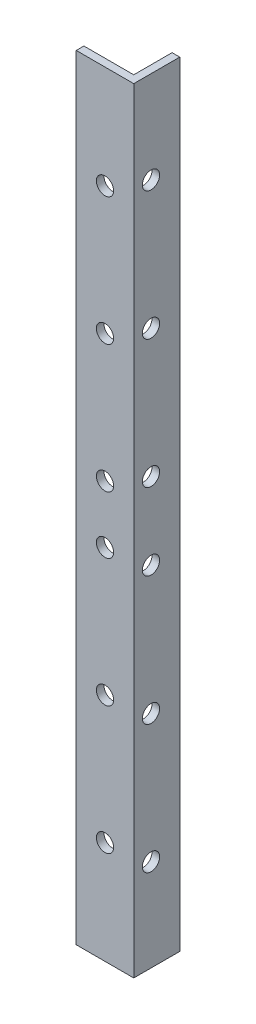
ISO-10303-21;
HEADER;
FILE_DESCRIPTION(('STEP AP214'),'2;1');
FILE_NAME('part.step','',(''),(''),'','','');
FILE_SCHEMA(('AUTOMOTIVE_DESIGN { 1 0 10303 214 1 1 1 1 }'));
ENDSEC;
DATA;
#1=APPLICATION_CONTEXT('core data for automotive mechanical design processes');
#2=APPLICATION_PROTOCOL_DEFINITION('international standard','automotive_design',2000,#1);
#3=PRODUCT_CONTEXT('',#1,'mechanical');
#4=PRODUCT('Part','Part','',(#3));
#5=PRODUCT_RELATED_PRODUCT_CATEGORY('part','',(#4));
#6=PRODUCT_DEFINITION_FORMATION('','',#4);
#7=PRODUCT_DEFINITION_CONTEXT('part definition',#1,'design');
#8=PRODUCT_DEFINITION('design','',#6,#7);
#9=PRODUCT_DEFINITION_SHAPE('','',#8);
#10=(LENGTH_UNIT() NAMED_UNIT(*) SI_UNIT(.MILLI.,.METRE.));
#11=(NAMED_UNIT(*) PLANE_ANGLE_UNIT() SI_UNIT($,.RADIAN.));
#12=(NAMED_UNIT(*) SI_UNIT($,.STERADIAN.) SOLID_ANGLE_UNIT());
#13=UNCERTAINTY_MEASURE_WITH_UNIT(LENGTH_MEASURE(1.E-05),#10,'distance_accuracy_value','');
#14=(GEOMETRIC_REPRESENTATION_CONTEXT(3) GLOBAL_UNCERTAINTY_ASSIGNED_CONTEXT((#13)) GLOBAL_UNIT_ASSIGNED_CONTEXT((#10,
#11,#12)) REPRESENTATION_CONTEXT('',''));
#15=CARTESIAN_POINT('',(0.,0.,0.));
#16=DIRECTION('',(0.,0.,1.));
#17=DIRECTION('',(1.,0.,0.));
#18=AXIS2_PLACEMENT_3D('',#15,#16,#17);
#19=CARTESIAN_POINT('',(0.,202.,-2.));
#20=DIRECTION('',(1.,0.,0.));
#21=DIRECTION('',(0.,0.,-1.));
#22=AXIS2_PLACEMENT_3D('',#19,#20,#21);
#23=PLANE('',#22);
#24=DIRECTION('',(0.,0.,1.));
#25=VECTOR('',#24,1.);
#26=CARTESIAN_POINT('',(0.,0.,-2.));
#27=LINE('',#26,#25);
#28=CARTESIAN_POINT('',(0.,0.,-2.));
#29=VERTEX_POINT('',#28);
#30=CARTESIAN_POINT('',(0.,0.,0.));
#31=VERTEX_POINT('',#30);
#32=EDGE_CURVE('E123',#29,#31,#27,.T.);
#33=ORIENTED_EDGE('',*,*,#32,.T.);
#34=DIRECTION('',(0.,-1.,0.));
#35=VECTOR('',#34,1.);
#36=CARTESIAN_POINT('',(0.,202.,0.));
#37=LINE('',#36,#35);
#38=CARTESIAN_POINT('',(0.,202.,0.));
#39=VERTEX_POINT('',#38);
#40=EDGE_CURVE('E11',#39,#31,#37,.T.);
#41=ORIENTED_EDGE('',*,*,#40,.F.);
#42=DIRECTION('',(0.,0.,1.));
#43=VECTOR('',#42,1.);
#44=CARTESIAN_POINT('',(0.,202.,-2.));
#45=LINE('',#44,#43);
#46=CARTESIAN_POINT('',(0.,202.,-2.));
#47=VERTEX_POINT('',#46);
#48=EDGE_CURVE('E134',#47,#39,#45,.T.);
#49=ORIENTED_EDGE('',*,*,#48,.F.);
#50=DIRECTION('',(0.,-1.,0.));
#51=VECTOR('',#50,1.);
#52=CARTESIAN_POINT('',(0.,202.,-2.));
#53=LINE('',#52,#51);
#54=EDGE_CURVE('E119',#47,#29,#53,.T.);
#55=ORIENTED_EDGE('',*,*,#54,.T.);
#56=EDGE_LOOP('',(#33,#41,#49,#55));
#57=FACE_BOUND('',#56,.T.);
#58=ADVANCED_FACE('F39',(#57),#23,.F.);
#59=CARTESIAN_POINT('',(0.,202.,0.));
#60=DIRECTION('',(0.,0.,-1.));
#61=DIRECTION('',(-1.,0.,0.));
#62=AXIS2_PLACEMENT_3D('',#59,#60,#61);
#63=PLANE('',#62);
#64=CARTESIAN_POINT('',(7.50000000000005,175.166666666667,0.));
#65=DIRECTION('',(0.,0.,1.));
#66=DIRECTION('',(1.,0.,0.));
#67=AXIS2_PLACEMENT_3D('',#64,#65,#66);
#68=CIRCLE('',#67,2.24999999999998);
#69=CARTESIAN_POINT('',(9.75000000000003,175.166666666667,0.));
#70=VERTEX_POINT('',#69);
#71=EDGE_CURVE('E463',#70,#70,#68,.T.);
#72=ORIENTED_EDGE('',*,*,#71,.F.);
#73=EDGE_LOOP('',(#72));
#74=FACE_BOUND('',#73,.T.);
#75=CARTESIAN_POINT('',(7.50000000000005,141.833333333333,0.));
#76=DIRECTION('',(0.,0.,1.));
#77=DIRECTION('',(1.,0.,0.));
#78=AXIS2_PLACEMENT_3D('',#75,#76,#77);
#79=CIRCLE('',#78,2.25);
#80=CARTESIAN_POINT('',(9.75000000000005,141.833333333333,0.));
#81=VERTEX_POINT('',#80);
#82=EDGE_CURVE('E466',#81,#81,#79,.T.);
#83=ORIENTED_EDGE('',*,*,#82,.F.);
#84=EDGE_LOOP('',(#83));
#85=FACE_BOUND('',#84,.T.);
#86=CARTESIAN_POINT('',(7.50000000000005,108.5,0.));
#87=DIRECTION('',(0.,0.,1.));
#88=DIRECTION('',(1.,0.,0.));
#89=AXIS2_PLACEMENT_3D('',#86,#87,#88);
#90=CIRCLE('',#89,2.25);
#91=CARTESIAN_POINT('',(9.75000000000005,108.5,0.));
#92=VERTEX_POINT('',#91);
#93=EDGE_CURVE('E472',#92,#92,#90,.T.);
#94=ORIENTED_EDGE('',*,*,#93,.F.);
#95=EDGE_LOOP('',(#94));
#96=FACE_BOUND('',#95,.T.);
#97=CARTESIAN_POINT('',(7.50000000000005,93.5,0.));
#98=DIRECTION('',(0.,0.,1.));
#99=DIRECTION('',(1.,0.,0.));
#100=AXIS2_PLACEMENT_3D('',#97,#98,#99);
#101=CIRCLE('',#100,2.25);
#102=CARTESIAN_POINT('',(9.75000000000005,93.5,0.));
#103=VERTEX_POINT('',#102);
#104=EDGE_CURVE('E478',#103,#103,#101,.T.);
#105=ORIENTED_EDGE('',*,*,#104,.F.);
#106=EDGE_LOOP('',(#105));
#107=FACE_BOUND('',#106,.T.);
#108=CARTESIAN_POINT('',(7.50000000000005,60.1666666666667,0.));
#109=DIRECTION('',(0.,0.,1.));
#110=DIRECTION('',(1.,0.,0.));
#111=AXIS2_PLACEMENT_3D('',#108,#109,#110);
#112=CIRCLE('',#111,2.24999999999998);
#113=CARTESIAN_POINT('',(9.75000000000003,60.1666666666667,0.));
#114=VERTEX_POINT('',#113);
#115=EDGE_CURVE('E484',#114,#114,#112,.T.);
#116=ORIENTED_EDGE('',*,*,#115,.F.);
#117=EDGE_LOOP('',(#116));
#118=FACE_BOUND('',#117,.T.);
#119=CARTESIAN_POINT('',(7.50000000000005,26.8333333333334,0.));
#120=DIRECTION('',(0.,0.,1.));
#121=DIRECTION('',(1.,0.,0.));
#122=AXIS2_PLACEMENT_3D('',#119,#120,#121);
#123=CIRCLE('',#122,2.24999999999999);
#124=CARTESIAN_POINT('',(9.75000000000004,26.8333333333334,0.));
#125=VERTEX_POINT('',#124);
#126=EDGE_CURVE('E429',#125,#125,#123,.T.);
#127=ORIENTED_EDGE('',*,*,#126,.F.);
#128=EDGE_LOOP('',(#127));
#129=FACE_BOUND('',#128,.T.);
#130=DIRECTION('',(1.,0.,0.));
#131=VECTOR('',#130,1.);
#132=CARTESIAN_POINT('',(0.,0.,0.));
#133=LINE('',#132,#131);
#134=CARTESIAN_POINT('',(15.,0.,0.));
#135=VERTEX_POINT('',#134);
#136=EDGE_CURVE('E126',#31,#135,#133,.T.);
#137=ORIENTED_EDGE('',*,*,#136,.T.);
#138=DIRECTION('',(0.,-1.,0.));
#139=VECTOR('',#138,1.);
#140=CARTESIAN_POINT('',(15.,202.,0.));
#141=LINE('',#140,#139);
#142=CARTESIAN_POINT('',(15.,202.,0.));
#143=VERTEX_POINT('',#142);
#144=EDGE_CURVE('E47',#143,#135,#141,.T.);
#145=ORIENTED_EDGE('',*,*,#144,.F.);
#146=DIRECTION('',(1.,0.,0.));
#147=VECTOR('',#146,1.);
#148=CARTESIAN_POINT('',(0.,202.,0.));
#149=LINE('',#148,#147);
#150=EDGE_CURVE('E92',#39,#143,#149,.T.);
#151=ORIENTED_EDGE('',*,*,#150,.F.);
#152=ORIENTED_EDGE('',*,*,#40,.T.);
#153=EDGE_LOOP('',(#137,#145,#151,#152));
#154=FACE_BOUND('',#153,.T.);
#155=ADVANCED_FACE('F162',(#74,#85,#96,#107,#118,#129,#154),#63,.F.);
#156=CARTESIAN_POINT('',(15.,202.,0.));
#157=DIRECTION('',(-1.,0.,0.));
#158=DIRECTION('',(0.,0.,1.));
#159=AXIS2_PLACEMENT_3D('',#156,#157,#158);
#160=PLANE('',#159);
#161=CARTESIAN_POINT('',(15.,23.9999999999999,-4.50000000000011));
#162=DIRECTION('',(1.,0.,0.));
#163=DIRECTION('',(0.,0.,-1.));
#164=AXIS2_PLACEMENT_3D('',#161,#162,#163);
#165=CIRCLE('',#164,2.24999999999999);
#166=CARTESIAN_POINT('',(15.,23.9999999999999,-6.7500000000001));
#167=VERTEX_POINT('',#166);
#168=EDGE_CURVE('E422',#167,#167,#165,.T.);
#169=ORIENTED_EDGE('',*,*,#168,.F.);
#170=EDGE_LOOP('',(#169));
#171=FACE_BOUND('',#170,.T.);
#172=CARTESIAN_POINT('',(15.,57.4999999999999,-4.50000000000011));
#173=DIRECTION('',(1.,0.,0.));
#174=DIRECTION('',(0.,0.,-1.));
#175=AXIS2_PLACEMENT_3D('',#172,#173,#174);
#176=CIRCLE('',#175,2.24999999999999);
#177=CARTESIAN_POINT('',(15.,57.4999999999999,-6.7500000000001));
#178=VERTEX_POINT('',#177);
#179=EDGE_CURVE('E431',#178,#178,#176,.T.);
#180=ORIENTED_EDGE('',*,*,#179,.F.);
#181=EDGE_LOOP('',(#180));
#182=FACE_BOUND('',#181,.T.);
#183=CARTESIAN_POINT('',(15.,90.9999999999999,-4.50000000000006));
#184=DIRECTION('',(1.,0.,0.));
#185=DIRECTION('',(0.,0.,-1.));
#186=AXIS2_PLACEMENT_3D('',#183,#184,#185);
#187=CIRCLE('',#186,2.24999999999999);
#188=CARTESIAN_POINT('',(15.,90.9999999999999,-6.75000000000005));
#189=VERTEX_POINT('',#188);
#190=EDGE_CURVE('E437',#189,#189,#187,.T.);
#191=ORIENTED_EDGE('',*,*,#190,.F.);
#192=EDGE_LOOP('',(#191));
#193=FACE_BOUND('',#192,.T.);
#194=CARTESIAN_POINT('',(15.,111.,-4.50000000000006));
#195=DIRECTION('',(1.,0.,0.));
#196=DIRECTION('',(0.,0.,-1.));
#197=AXIS2_PLACEMENT_3D('',#194,#195,#196);
#198=CIRCLE('',#197,2.24999999999999);
#199=CARTESIAN_POINT('',(15.,111.,-6.75000000000005));
#200=VERTEX_POINT('',#199);
#201=EDGE_CURVE('E443',#200,#200,#198,.T.);
#202=ORIENTED_EDGE('',*,*,#201,.F.);
#203=EDGE_LOOP('',(#202));
#204=FACE_BOUND('',#203,.T.);
#205=CARTESIAN_POINT('',(15.,144.5,-4.50000000000011));
#206=DIRECTION('',(1.,0.,0.));
#207=DIRECTION('',(0.,0.,-1.));
#208=AXIS2_PLACEMENT_3D('',#205,#206,#207);
#209=CIRCLE('',#208,2.25);
#210=CARTESIAN_POINT('',(15.,144.5,-6.75000000000012));
#211=VERTEX_POINT('',#210);
#212=EDGE_CURVE('E449',#211,#211,#209,.T.);
#213=ORIENTED_EDGE('',*,*,#212,.F.);
#214=EDGE_LOOP('',(#213));
#215=FACE_BOUND('',#214,.T.);
#216=CARTESIAN_POINT('',(15.,178.,-4.50000000000011));
#217=DIRECTION('',(1.,0.,0.));
#218=DIRECTION('',(0.,0.,-1.));
#219=AXIS2_PLACEMENT_3D('',#216,#217,#218);
#220=CIRCLE('',#219,2.25);
#221=CARTESIAN_POINT('',(15.,178.,-6.75000000000012));
#222=VERTEX_POINT('',#221);
#223=EDGE_CURVE('E455',#222,#222,#220,.T.);
#224=ORIENTED_EDGE('',*,*,#223,.F.);
#225=EDGE_LOOP('',(#224));
#226=FACE_BOUND('',#225,.T.);
#227=DIRECTION('',(0.,0.,-1.));
#228=VECTOR('',#227,1.);
#229=CARTESIAN_POINT('',(15.,0.,0.));
#230=LINE('',#229,#228);
#231=CARTESIAN_POINT('',(15.,0.,-12.));
#232=VERTEX_POINT('',#231);
#233=EDGE_CURVE('E129',#135,#232,#230,.T.);
#234=ORIENTED_EDGE('',*,*,#233,.T.);
#235=DIRECTION('',(0.,-1.,0.));
#236=VECTOR('',#235,1.);
#237=CARTESIAN_POINT('',(15.,202.,-12.));
#238=LINE('',#237,#236);
#239=CARTESIAN_POINT('',(15.,202.,-12.));
#240=VERTEX_POINT('',#239);
#241=EDGE_CURVE('E114',#240,#232,#238,.T.);
#242=ORIENTED_EDGE('',*,*,#241,.F.);
#243=DIRECTION('',(0.,0.,-1.));
#244=VECTOR('',#243,1.);
#245=CARTESIAN_POINT('',(15.,202.,0.));
#246=LINE('',#245,#244);
#247=EDGE_CURVE('E105',#143,#240,#246,.T.);
#248=ORIENTED_EDGE('',*,*,#247,.F.);
#249=ORIENTED_EDGE('',*,*,#144,.T.);
#250=EDGE_LOOP('',(#234,#242,#248,#249));
#251=FACE_BOUND('',#250,.T.);
#252=ADVANCED_FACE('F140',(#171,#182,#193,#204,#215,#226,#251),#160,.F.);
#253=CARTESIAN_POINT('',(15.,202.,-12.));
#254=DIRECTION('',(0.,0.,1.));
#255=DIRECTION('',(1.,0.,0.));
#256=AXIS2_PLACEMENT_3D('',#253,#254,#255);
#257=PLANE('',#256);
#258=DIRECTION('',(-1.,0.,0.));
#259=VECTOR('',#258,1.);
#260=CARTESIAN_POINT('',(15.,0.,-12.));
#261=LINE('',#260,#259);
#262=CARTESIAN_POINT('',(13.,0.,-12.));
#263=VERTEX_POINT('',#262);
#264=EDGE_CURVE('E113',#232,#263,#261,.T.);
#265=ORIENTED_EDGE('',*,*,#264,.T.);
#266=DIRECTION('',(0.,-1.,0.));
#267=VECTOR('',#266,1.);
#268=CARTESIAN_POINT('',(13.,202.,-12.));
#269=LINE('',#268,#267);
#270=CARTESIAN_POINT('',(13.,202.,-12.));
#271=VERTEX_POINT('',#270);
#272=EDGE_CURVE('E110',#271,#263,#269,.T.);
#273=ORIENTED_EDGE('',*,*,#272,.F.);
#274=DIRECTION('',(-1.,0.,0.));
#275=VECTOR('',#274,1.);
#276=CARTESIAN_POINT('',(15.,202.,-12.));
#277=LINE('',#276,#275);
#278=EDGE_CURVE('E99',#240,#271,#277,.T.);
#279=ORIENTED_EDGE('',*,*,#278,.F.);
#280=ORIENTED_EDGE('',*,*,#241,.T.);
#281=EDGE_LOOP('',(#265,#273,#279,#280));
#282=FACE_BOUND('',#281,.T.);
#283=ADVANCED_FACE('F111',(#282),#257,.F.);
#284=CARTESIAN_POINT('',(13.,202.,-12.));
#285=DIRECTION('',(1.,0.,0.));
#286=DIRECTION('',(0.,0.,-1.));
#287=AXIS2_PLACEMENT_3D('',#284,#285,#286);
#288=PLANE('',#287);
#289=CARTESIAN_POINT('',(13.,23.9999999999999,-4.50000000000011));
#290=DIRECTION('',(1.,0.,0.));
#291=DIRECTION('',(0.,0.,-1.));
#292=AXIS2_PLACEMENT_3D('',#289,#290,#291);
#293=CIRCLE('',#292,2.24999999999999);
#294=CARTESIAN_POINT('',(13.,23.9999999999999,-6.7500000000001));
#295=VERTEX_POINT('',#294);
#296=EDGE_CURVE('E425',#295,#295,#293,.F.);
#297=ORIENTED_EDGE('',*,*,#296,.F.);
#298=EDGE_LOOP('',(#297));
#299=FACE_BOUND('',#298,.T.);
#300=CARTESIAN_POINT('',(13.,57.4999999999999,-4.50000000000011));
#301=DIRECTION('',(1.,0.,0.));
#302=DIRECTION('',(0.,0.,-1.));
#303=AXIS2_PLACEMENT_3D('',#300,#301,#302);
#304=CIRCLE('',#303,2.24999999999999);
#305=CARTESIAN_POINT('',(13.,57.4999999999999,-6.7500000000001));
#306=VERTEX_POINT('',#305);
#307=EDGE_CURVE('E434',#306,#306,#304,.F.);
#308=ORIENTED_EDGE('',*,*,#307,.F.);
#309=EDGE_LOOP('',(#308));
#310=FACE_BOUND('',#309,.T.);
#311=CARTESIAN_POINT('',(13.,90.9999999999999,-4.50000000000006));
#312=DIRECTION('',(1.,0.,0.));
#313=DIRECTION('',(0.,0.,-1.));
#314=AXIS2_PLACEMENT_3D('',#311,#312,#313);
#315=CIRCLE('',#314,2.24999999999999);
#316=CARTESIAN_POINT('',(13.,90.9999999999999,-6.75000000000005));
#317=VERTEX_POINT('',#316);
#318=EDGE_CURVE('E440',#317,#317,#315,.F.);
#319=ORIENTED_EDGE('',*,*,#318,.F.);
#320=EDGE_LOOP('',(#319));
#321=FACE_BOUND('',#320,.T.);
#322=CARTESIAN_POINT('',(13.,111.,-4.50000000000006));
#323=DIRECTION('',(1.,0.,0.));
#324=DIRECTION('',(0.,0.,-1.));
#325=AXIS2_PLACEMENT_3D('',#322,#323,#324);
#326=CIRCLE('',#325,2.24999999999999);
#327=CARTESIAN_POINT('',(13.,111.,-6.75000000000005));
#328=VERTEX_POINT('',#327);
#329=EDGE_CURVE('E446',#328,#328,#326,.F.);
#330=ORIENTED_EDGE('',*,*,#329,.F.);
#331=EDGE_LOOP('',(#330));
#332=FACE_BOUND('',#331,.T.);
#333=CARTESIAN_POINT('',(13.,144.5,-4.50000000000011));
#334=DIRECTION('',(1.,0.,0.));
#335=DIRECTION('',(0.,0.,-1.));
#336=AXIS2_PLACEMENT_3D('',#333,#334,#335);
#337=CIRCLE('',#336,2.25);
#338=CARTESIAN_POINT('',(13.,144.5,-6.75000000000012));
#339=VERTEX_POINT('',#338);
#340=EDGE_CURVE('E452',#339,#339,#337,.F.);
#341=ORIENTED_EDGE('',*,*,#340,.F.);
#342=EDGE_LOOP('',(#341));
#343=FACE_BOUND('',#342,.T.);
#344=CARTESIAN_POINT('',(13.,178.,-4.50000000000011));
#345=DIRECTION('',(1.,0.,0.));
#346=DIRECTION('',(0.,0.,-1.));
#347=AXIS2_PLACEMENT_3D('',#344,#345,#346);
#348=CIRCLE('',#347,2.25);
#349=CARTESIAN_POINT('',(13.,178.,-6.75000000000012));
#350=VERTEX_POINT('',#349);
#351=EDGE_CURVE('E458',#350,#350,#348,.F.);
#352=ORIENTED_EDGE('',*,*,#351,.F.);
#353=EDGE_LOOP('',(#352));
#354=FACE_BOUND('',#353,.T.);
#355=DIRECTION('',(0.,0.,1.));
#356=VECTOR('',#355,1.);
#357=CARTESIAN_POINT('',(13.,0.,-12.));
#358=LINE('',#357,#356);
#359=CARTESIAN_POINT('',(13.,0.,-2.));
#360=VERTEX_POINT('',#359);
#361=EDGE_CURVE('E78',#263,#360,#358,.T.);
#362=ORIENTED_EDGE('',*,*,#361,.T.);
#363=DIRECTION('',(0.,-1.,0.));
#364=VECTOR('',#363,1.);
#365=CARTESIAN_POINT('',(13.,202.,-2.));
#366=LINE('',#365,#364);
#367=CARTESIAN_POINT('',(13.,202.,-2.));
#368=VERTEX_POINT('',#367);
#369=EDGE_CURVE('E115',#368,#360,#366,.T.);
#370=ORIENTED_EDGE('',*,*,#369,.F.);
#371=DIRECTION('',(0.,0.,1.));
#372=VECTOR('',#371,1.);
#373=CARTESIAN_POINT('',(13.,202.,-12.));
#374=LINE('',#373,#372);
#375=EDGE_CURVE('E103',#271,#368,#374,.T.);
#376=ORIENTED_EDGE('',*,*,#375,.F.);
#377=ORIENTED_EDGE('',*,*,#272,.T.);
#378=EDGE_LOOP('',(#362,#370,#376,#377));
#379=FACE_BOUND('',#378,.T.);
#380=ADVANCED_FACE('F117',(#299,#310,#321,#332,#343,#354,#379),#288,.F.);
#381=CARTESIAN_POINT('',(13.,202.,-2.));
#382=DIRECTION('',(0.,0.,1.));
#383=DIRECTION('',(1.,0.,0.));
#384=AXIS2_PLACEMENT_3D('',#381,#382,#383);
#385=PLANE('',#384);
#386=CARTESIAN_POINT('',(7.50000000000005,175.166666666667,-2.));
#387=DIRECTION('',(0.,0.,1.));
#388=DIRECTION('',(1.,0.,0.));
#389=AXIS2_PLACEMENT_3D('',#386,#387,#388);
#390=CIRCLE('',#389,2.24999999999998);
#391=CARTESIAN_POINT('',(9.75000000000003,175.166666666667,-2.));
#392=VERTEX_POINT('',#391);
#393=EDGE_CURVE('E127',#392,#392,#390,.F.);
#394=ORIENTED_EDGE('',*,*,#393,.F.);
#395=EDGE_LOOP('',(#394));
#396=FACE_BOUND('',#395,.T.);
#397=CARTESIAN_POINT('',(7.50000000000005,141.833333333333,-2.));
#398=DIRECTION('',(0.,0.,1.));
#399=DIRECTION('',(1.,0.,0.));
#400=AXIS2_PLACEMENT_3D('',#397,#398,#399);
#401=CIRCLE('',#400,2.25);
#402=CARTESIAN_POINT('',(9.75000000000005,141.833333333333,-2.));
#403=VERTEX_POINT('',#402);
#404=EDGE_CURVE('E469',#403,#403,#401,.F.);
#405=ORIENTED_EDGE('',*,*,#404,.F.);
#406=EDGE_LOOP('',(#405));
#407=FACE_BOUND('',#406,.T.);
#408=CARTESIAN_POINT('',(7.50000000000005,108.5,-2.));
#409=DIRECTION('',(0.,0.,1.));
#410=DIRECTION('',(1.,0.,0.));
#411=AXIS2_PLACEMENT_3D('',#408,#409,#410);
#412=CIRCLE('',#411,2.25);
#413=CARTESIAN_POINT('',(9.75000000000005,108.5,-2.));
#414=VERTEX_POINT('',#413);
#415=EDGE_CURVE('E475',#414,#414,#412,.F.);
#416=ORIENTED_EDGE('',*,*,#415,.F.);
#417=EDGE_LOOP('',(#416));
#418=FACE_BOUND('',#417,.T.);
#419=CARTESIAN_POINT('',(7.50000000000005,93.5,-2.));
#420=DIRECTION('',(0.,0.,1.));
#421=DIRECTION('',(1.,0.,0.));
#422=AXIS2_PLACEMENT_3D('',#419,#420,#421);
#423=CIRCLE('',#422,2.25);
#424=CARTESIAN_POINT('',(9.75000000000005,93.5,-2.));
#425=VERTEX_POINT('',#424);
#426=EDGE_CURVE('E481',#425,#425,#423,.F.);
#427=ORIENTED_EDGE('',*,*,#426,.F.);
#428=EDGE_LOOP('',(#427));
#429=FACE_BOUND('',#428,.T.);
#430=CARTESIAN_POINT('',(7.50000000000005,60.1666666666667,-2.));
#431=DIRECTION('',(0.,0.,1.));
#432=DIRECTION('',(1.,0.,0.));
#433=AXIS2_PLACEMENT_3D('',#430,#431,#432);
#434=CIRCLE('',#433,2.24999999999998);
#435=CARTESIAN_POINT('',(9.75000000000003,60.1666666666667,-2.));
#436=VERTEX_POINT('',#435);
#437=EDGE_CURVE('E487',#436,#436,#434,.F.);
#438=ORIENTED_EDGE('',*,*,#437,.F.);
#439=EDGE_LOOP('',(#438));
#440=FACE_BOUND('',#439,.T.);
#441=CARTESIAN_POINT('',(7.50000000000005,26.8333333333334,-2.));
#442=DIRECTION('',(0.,0.,1.));
#443=DIRECTION('',(1.,0.,0.));
#444=AXIS2_PLACEMENT_3D('',#441,#442,#443);
#445=CIRCLE('',#444,2.24999999999999);
#446=CARTESIAN_POINT('',(9.75000000000004,26.8333333333334,-2.));
#447=VERTEX_POINT('',#446);
#448=EDGE_CURVE('E426',#447,#447,#445,.F.);
#449=ORIENTED_EDGE('',*,*,#448,.F.);
#450=EDGE_LOOP('',(#449));
#451=FACE_BOUND('',#450,.T.);
#452=DIRECTION('',(-1.,0.,0.));
#453=VECTOR('',#452,1.);
#454=CARTESIAN_POINT('',(13.,0.,-2.));
#455=LINE('',#454,#453);
#456=EDGE_CURVE('E84',#360,#29,#455,.T.);
#457=ORIENTED_EDGE('',*,*,#456,.T.);
#458=ORIENTED_EDGE('',*,*,#54,.F.);
#459=DIRECTION('',(-1.,0.,0.));
#460=VECTOR('',#459,1.);
#461=CARTESIAN_POINT('',(13.,202.,-2.));
#462=LINE('',#461,#460);
#463=EDGE_CURVE('E55',#368,#47,#462,.T.);
#464=ORIENTED_EDGE('',*,*,#463,.F.);
#465=ORIENTED_EDGE('',*,*,#369,.T.);
#466=EDGE_LOOP('',(#457,#458,#464,#465));
#467=FACE_BOUND('',#466,.T.);
#468=ADVANCED_FACE('F147',(#396,#407,#418,#429,#440,#451,#467),#385,.F.);
#469=CARTESIAN_POINT('',(0.,202.,0.));
#470=DIRECTION('',(0.,1.,0.));
#471=DIRECTION('',(0.,0.,1.));
#472=AXIS2_PLACEMENT_3D('',#469,#470,#471);
#473=PLANE('',#472);
#474=ORIENTED_EDGE('',*,*,#48,.T.);
#475=ORIENTED_EDGE('',*,*,#150,.T.);
#476=ORIENTED_EDGE('',*,*,#247,.T.);
#477=ORIENTED_EDGE('',*,*,#278,.T.);
#478=ORIENTED_EDGE('',*,*,#375,.T.);
#479=ORIENTED_EDGE('',*,*,#463,.T.);
#480=EDGE_LOOP('',(#474,#475,#476,#477,#478,#479));
#481=FACE_BOUND('',#480,.T.);
#482=ADVANCED_FACE('F101',(#481),#473,.T.);
#483=CARTESIAN_POINT('',(0.,0.,0.));
#484=DIRECTION('',(0.,1.,0.));
#485=DIRECTION('',(0.,0.,1.));
#486=AXIS2_PLACEMENT_3D('',#483,#484,#485);
#487=PLANE('',#486);
#488=ORIENTED_EDGE('',*,*,#32,.F.);
#489=ORIENTED_EDGE('',*,*,#456,.F.);
#490=ORIENTED_EDGE('',*,*,#361,.F.);
#491=ORIENTED_EDGE('',*,*,#264,.F.);
#492=ORIENTED_EDGE('',*,*,#233,.F.);
#493=ORIENTED_EDGE('',*,*,#136,.F.);
#494=EDGE_LOOP('',(#488,#489,#490,#491,#492,#493));
#495=FACE_BOUND('',#494,.T.);
#496=ADVANCED_FACE('F143',(#495),#487,.F.);
#497=CARTESIAN_POINT('',(7.50000000000005,26.8333333333334,-12.001));
#498=DIRECTION('',(0.,0.,1.));
#499=DIRECTION('',(1.,0.,0.));
#500=AXIS2_PLACEMENT_3D('',#497,#498,#499);
#501=CYLINDRICAL_SURFACE('',#500,2.24999999999999);
#502=ORIENTED_EDGE('',*,*,#126,.T.);
#503=EDGE_LOOP('',(#502));
#504=FACE_BOUND('',#503,.T.);
#505=ORIENTED_EDGE('',*,*,#448,.T.);
#506=EDGE_LOOP('',(#505));
#507=FACE_BOUND('',#506,.T.);
#508=ADVANCED_FACE('F207',(#504,#507),#501,.F.);
#509=CARTESIAN_POINT('',(7.50000000000005,60.1666666666667,-12.001));
#510=DIRECTION('',(0.,0.,1.));
#511=DIRECTION('',(1.,0.,0.));
#512=AXIS2_PLACEMENT_3D('',#509,#510,#511);
#513=CYLINDRICAL_SURFACE('',#512,2.24999999999998);
#514=ORIENTED_EDGE('',*,*,#115,.T.);
#515=EDGE_LOOP('',(#514));
#516=FACE_BOUND('',#515,.T.);
#517=ORIENTED_EDGE('',*,*,#437,.T.);
#518=EDGE_LOOP('',(#517));
#519=FACE_BOUND('',#518,.T.);
#520=ADVANCED_FACE('F214',(#516,#519),#513,.F.);
#521=CARTESIAN_POINT('',(7.50000000000005,93.5,-12.001));
#522=DIRECTION('',(0.,0.,1.));
#523=DIRECTION('',(1.,0.,0.));
#524=AXIS2_PLACEMENT_3D('',#521,#522,#523);
#525=CYLINDRICAL_SURFACE('',#524,2.25);
#526=ORIENTED_EDGE('',*,*,#104,.T.);
#527=EDGE_LOOP('',(#526));
#528=FACE_BOUND('',#527,.T.);
#529=ORIENTED_EDGE('',*,*,#426,.T.);
#530=EDGE_LOOP('',(#529));
#531=FACE_BOUND('',#530,.T.);
#532=ADVANCED_FACE('F224',(#528,#531),#525,.F.);
#533=CARTESIAN_POINT('',(7.50000000000005,108.5,-12.001));
#534=DIRECTION('',(0.,0.,1.));
#535=DIRECTION('',(1.,0.,0.));
#536=AXIS2_PLACEMENT_3D('',#533,#534,#535);
#537=CYLINDRICAL_SURFACE('',#536,2.25);
#538=ORIENTED_EDGE('',*,*,#93,.T.);
#539=EDGE_LOOP('',(#538));
#540=FACE_BOUND('',#539,.T.);
#541=ORIENTED_EDGE('',*,*,#415,.T.);
#542=EDGE_LOOP('',(#541));
#543=FACE_BOUND('',#542,.T.);
#544=ADVANCED_FACE('F234',(#540,#543),#537,.F.);
#545=CARTESIAN_POINT('',(7.50000000000005,141.833333333333,-12.001));
#546=DIRECTION('',(0.,0.,1.));
#547=DIRECTION('',(1.,0.,0.));
#548=AXIS2_PLACEMENT_3D('',#545,#546,#547);
#549=CYLINDRICAL_SURFACE('',#548,2.25);
#550=ORIENTED_EDGE('',*,*,#82,.T.);
#551=EDGE_LOOP('',(#550));
#552=FACE_BOUND('',#551,.T.);
#553=ORIENTED_EDGE('',*,*,#404,.T.);
#554=EDGE_LOOP('',(#553));
#555=FACE_BOUND('',#554,.T.);
#556=ADVANCED_FACE('F244',(#552,#555),#549,.F.);
#557=CARTESIAN_POINT('',(7.50000000000005,175.166666666667,-12.001));
#558=DIRECTION('',(0.,0.,1.));
#559=DIRECTION('',(1.,0.,0.));
#560=AXIS2_PLACEMENT_3D('',#557,#558,#559);
#561=CYLINDRICAL_SURFACE('',#560,2.24999999999998);
#562=ORIENTED_EDGE('',*,*,#71,.T.);
#563=EDGE_LOOP('',(#562));
#564=FACE_BOUND('',#563,.T.);
#565=ORIENTED_EDGE('',*,*,#393,.T.);
#566=EDGE_LOOP('',(#565));
#567=FACE_BOUND('',#566,.T.);
#568=ADVANCED_FACE('F254',(#564,#567),#561,.F.);
#569=CARTESIAN_POINT('',(-0.001000000000001,178.,-4.50000000000012));
#570=DIRECTION('',(1.,0.,0.));
#571=DIRECTION('',(0.,0.,-1.));
#572=AXIS2_PLACEMENT_3D('',#569,#570,#571);
#573=CYLINDRICAL_SURFACE('',#572,2.25);
#574=ORIENTED_EDGE('',*,*,#223,.T.);
#575=EDGE_LOOP('',(#574));
#576=FACE_BOUND('',#575,.T.);
#577=ORIENTED_EDGE('',*,*,#351,.T.);
#578=EDGE_LOOP('',(#577));
#579=FACE_BOUND('',#578,.T.);
#580=ADVANCED_FACE('F264',(#576,#579),#573,.F.);
#581=CARTESIAN_POINT('',(-0.001000000000001,144.5,-4.50000000000012));
#582=DIRECTION('',(1.,0.,0.));
#583=DIRECTION('',(0.,0.,-1.));
#584=AXIS2_PLACEMENT_3D('',#581,#582,#583);
#585=CYLINDRICAL_SURFACE('',#584,2.25);
#586=ORIENTED_EDGE('',*,*,#212,.T.);
#587=EDGE_LOOP('',(#586));
#588=FACE_BOUND('',#587,.T.);
#589=ORIENTED_EDGE('',*,*,#340,.T.);
#590=EDGE_LOOP('',(#589));
#591=FACE_BOUND('',#590,.T.);
#592=ADVANCED_FACE('F273',(#588,#591),#585,.F.);
#593=CARTESIAN_POINT('',(-0.001000000000001,111.,-4.50000000000006));
#594=DIRECTION('',(1.,0.,0.));
#595=DIRECTION('',(0.,0.,-1.));
#596=AXIS2_PLACEMENT_3D('',#593,#594,#595);
#597=CYLINDRICAL_SURFACE('',#596,2.24999999999999);
#598=ORIENTED_EDGE('',*,*,#201,.T.);
#599=EDGE_LOOP('',(#598));
#600=FACE_BOUND('',#599,.T.);
#601=ORIENTED_EDGE('',*,*,#329,.T.);
#602=EDGE_LOOP('',(#601));
#603=FACE_BOUND('',#602,.T.);
#604=ADVANCED_FACE('F283',(#600,#603),#597,.F.);
#605=CARTESIAN_POINT('',(-0.001000000000001,90.9999999999999,-4.50000000000006));
#606=DIRECTION('',(1.,0.,0.));
#607=DIRECTION('',(0.,0.,-1.));
#608=AXIS2_PLACEMENT_3D('',#605,#606,#607);
#609=CYLINDRICAL_SURFACE('',#608,2.24999999999999);
#610=ORIENTED_EDGE('',*,*,#190,.T.);
#611=EDGE_LOOP('',(#610));
#612=FACE_BOUND('',#611,.T.);
#613=ORIENTED_EDGE('',*,*,#318,.T.);
#614=EDGE_LOOP('',(#613));
#615=FACE_BOUND('',#614,.T.);
#616=ADVANCED_FACE('F293',(#612,#615),#609,.F.);
#617=CARTESIAN_POINT('',(-0.001000000000001,57.4999999999999,-4.50000000000012));
#618=DIRECTION('',(1.,0.,0.));
#619=DIRECTION('',(0.,0.,-1.));
#620=AXIS2_PLACEMENT_3D('',#617,#618,#619);
#621=CYLINDRICAL_SURFACE('',#620,2.24999999999999);
#622=ORIENTED_EDGE('',*,*,#179,.T.);
#623=EDGE_LOOP('',(#622));
#624=FACE_BOUND('',#623,.T.);
#625=ORIENTED_EDGE('',*,*,#307,.T.);
#626=EDGE_LOOP('',(#625));
#627=FACE_BOUND('',#626,.T.);
#628=ADVANCED_FACE('F303',(#624,#627),#621,.F.);
#629=CARTESIAN_POINT('',(-0.001000000000001,23.9999999999999,-4.50000000000012));
#630=DIRECTION('',(1.,0.,0.));
#631=DIRECTION('',(0.,0.,-1.));
#632=AXIS2_PLACEMENT_3D('',#629,#630,#631);
#633=CYLINDRICAL_SURFACE('',#632,2.24999999999999);
#634=ORIENTED_EDGE('',*,*,#168,.T.);
#635=EDGE_LOOP('',(#634));
#636=FACE_BOUND('',#635,.T.);
#637=ORIENTED_EDGE('',*,*,#296,.T.);
#638=EDGE_LOOP('',(#637));
#639=FACE_BOUND('',#638,.T.);
#640=ADVANCED_FACE('F313',(#636,#639),#633,.F.);
#641=CLOSED_SHELL('',(#58,#155,#252,#283,#380,#468,#482,#496,#508,#520,#532,#544,#556,#568,#580,
#592,#604,#616,#628,#640));
#642=MANIFOLD_SOLID_BREP('B2',#641);
#643=ADVANCED_BREP_SHAPE_REPRESENTATION('',(#18,#642),#14);
#644=SHAPE_DEFINITION_REPRESENTATION(#9,#643);
ENDSEC;
END-ISO-10303-21;
